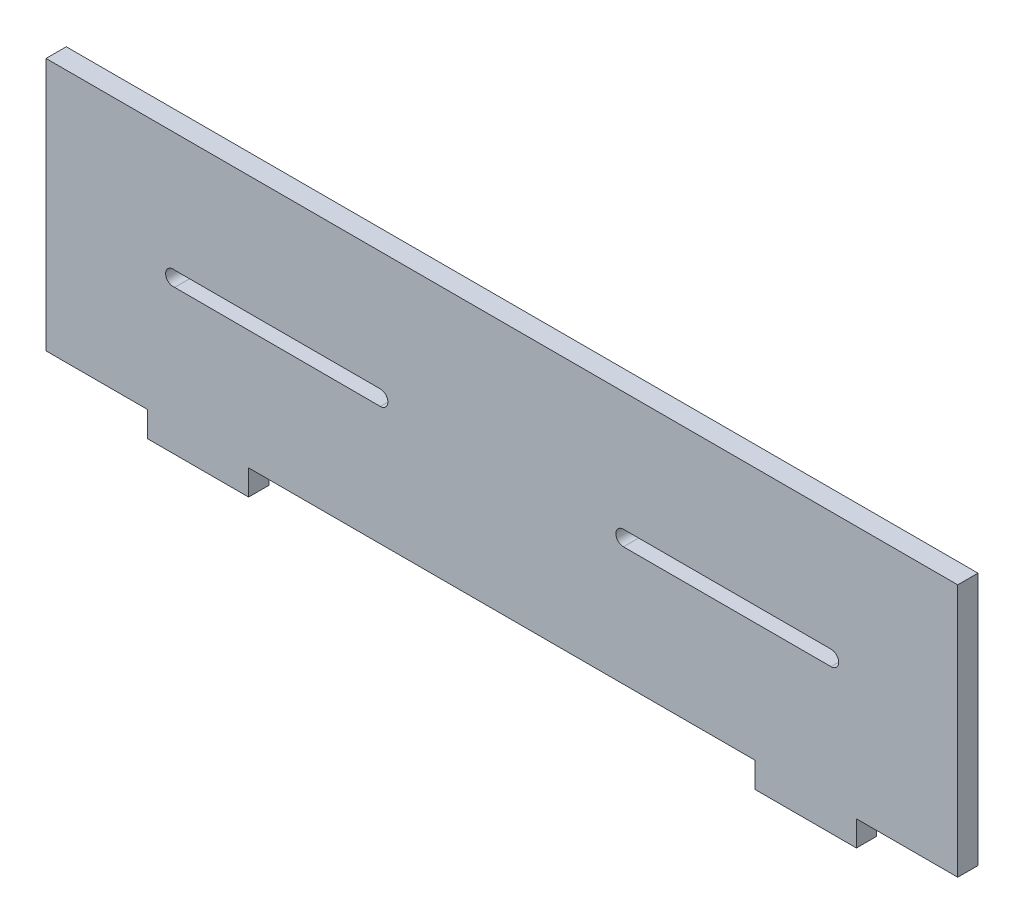
ISO-10303-21;
HEADER;
FILE_DESCRIPTION(('STEP AP214'),'2;1');
FILE_NAME('part.step','',(''),(''),'','','');
FILE_SCHEMA(('AUTOMOTIVE_DESIGN { 1 0 10303 214 1 1 1 1 }'));
ENDSEC;
DATA;
#1=APPLICATION_CONTEXT('core data for automotive mechanical design processes');
#2=APPLICATION_PROTOCOL_DEFINITION('international standard','automotive_design',2000,#1);
#3=PRODUCT_CONTEXT('',#1,'mechanical');
#4=PRODUCT('Part','Part','',(#3));
#5=PRODUCT_RELATED_PRODUCT_CATEGORY('part','',(#4));
#6=PRODUCT_DEFINITION_FORMATION('','',#4);
#7=PRODUCT_DEFINITION_CONTEXT('part definition',#1,'design');
#8=PRODUCT_DEFINITION('design','',#6,#7);
#9=PRODUCT_DEFINITION_SHAPE('','',#8);
#10=(LENGTH_UNIT() NAMED_UNIT(*) SI_UNIT(.MILLI.,.METRE.));
#11=(NAMED_UNIT(*) PLANE_ANGLE_UNIT() SI_UNIT($,.RADIAN.));
#12=(NAMED_UNIT(*) SI_UNIT($,.STERADIAN.) SOLID_ANGLE_UNIT());
#13=UNCERTAINTY_MEASURE_WITH_UNIT(LENGTH_MEASURE(1.E-05),#10,'distance_accuracy_value','');
#14=(GEOMETRIC_REPRESENTATION_CONTEXT(3) GLOBAL_UNCERTAINTY_ASSIGNED_CONTEXT((#13)) GLOBAL_UNIT_ASSIGNED_CONTEXT((#10,
#11,#12)) REPRESENTATION_CONTEXT('',''));
#15=CARTESIAN_POINT('',(0.,0.,0.));
#16=DIRECTION('',(0.,0.,1.));
#17=DIRECTION('',(1.,0.,0.));
#18=AXIS2_PLACEMENT_3D('',#15,#16,#17);
#19=CARTESIAN_POINT('',(72.7006420545748,-2.01784816785052E-13,4.));
#20=DIRECTION('',(1.,0.,0.));
#21=DIRECTION('',(0.,1.,0.));
#22=AXIS2_PLACEMENT_3D('',#19,#20,#21);
#23=PLANE('',#22);
#24=DIRECTION('',(0.,-1.,0.));
#25=VECTOR('',#24,1.);
#26=CARTESIAN_POINT('',(72.7006420545748,-2.01784816785052E-13,0.));
#27=LINE('',#26,#25);
#28=CARTESIAN_POINT('',(72.7006420545747,-31.117125984252,0.));
#29=VERTEX_POINT('',#28);
#30=CARTESIAN_POINT('',(72.7006420545747,-36.117125984252,0.));
#31=VERTEX_POINT('',#30);
#32=EDGE_CURVE('E275',#29,#31,#27,.T.);
#33=ORIENTED_EDGE('',*,*,#32,.F.);
#34=DIRECTION('',(0.,0.,-1.));
#35=VECTOR('',#34,1.);
#36=CARTESIAN_POINT('',(72.7006420545747,-31.117125984252,4.));
#37=LINE('',#36,#35);
#38=CARTESIAN_POINT('',(72.7006420545747,-31.117125984252,4.));
#39=VERTEX_POINT('',#38);
#40=EDGE_CURVE('E11',#39,#29,#37,.T.);
#41=ORIENTED_EDGE('',*,*,#40,.F.);
#42=DIRECTION('',(0.,-1.,0.));
#43=VECTOR('',#42,1.);
#44=CARTESIAN_POINT('',(72.7006420545748,-2.01784816785052E-13,4.));
#45=LINE('',#44,#43);
#46=CARTESIAN_POINT('',(72.7006420545747,-36.117125984252,4.));
#47=VERTEX_POINT('',#46);
#48=EDGE_CURVE('E323',#39,#47,#45,.T.);
#49=ORIENTED_EDGE('',*,*,#48,.T.);
#50=DIRECTION('',(0.,0.,-1.));
#51=VECTOR('',#50,1.);
#52=CARTESIAN_POINT('',(72.7006420545747,-36.117125984252,4.));
#53=LINE('',#52,#51);
#54=EDGE_CURVE('E122',#47,#31,#53,.T.);
#55=ORIENTED_EDGE('',*,*,#54,.T.);
#56=EDGE_LOOP('',(#33,#41,#49,#55));
#57=FACE_BOUND('',#56,.T.);
#58=ADVANCED_FACE('F33',(#57),#23,.T.);
#59=CARTESIAN_POINT('',(0.,-31.117125984252,4.));
#60=DIRECTION('',(0.,1.,0.));
#61=DIRECTION('',(0.,0.,1.));
#62=AXIS2_PLACEMENT_3D('',#59,#60,#61);
#63=PLANE('',#62);
#64=DIRECTION('',(1.,0.,0.));
#65=VECTOR('',#64,1.);
#66=CARTESIAN_POINT('',(0.,-31.117125984252,0.));
#67=LINE('',#66,#65);
#68=CARTESIAN_POINT('',(92.7006420545746,-31.117125984252,0.));
#69=VERTEX_POINT('',#68);
#70=EDGE_CURVE('E277',#29,#69,#67,.T.);
#71=ORIENTED_EDGE('',*,*,#70,.T.);
#72=DIRECTION('',(0.,0.,-1.));
#73=VECTOR('',#72,1.);
#74=CARTESIAN_POINT('',(92.7006420545746,-31.117125984252,4.));
#75=LINE('',#74,#73);
#76=CARTESIAN_POINT('',(92.7006420545746,-31.117125984252,4.));
#77=VERTEX_POINT('',#76);
#78=EDGE_CURVE('E43',#77,#69,#75,.T.);
#79=ORIENTED_EDGE('',*,*,#78,.F.);
#80=DIRECTION('',(1.,0.,0.));
#81=VECTOR('',#80,1.);
#82=CARTESIAN_POINT('',(0.,-31.117125984252,4.));
#83=LINE('',#82,#81);
#84=EDGE_CURVE('E325',#39,#77,#83,.T.);
#85=ORIENTED_EDGE('',*,*,#84,.F.);
#86=ORIENTED_EDGE('',*,*,#40,.T.);
#87=EDGE_LOOP('',(#71,#79,#85,#86));
#88=FACE_BOUND('',#87,.T.);
#89=ADVANCED_FACE('F372',(#88),#63,.F.);
#90=CARTESIAN_POINT('',(92.7006420545746,0.,4.));
#91=DIRECTION('',(1.,0.,0.));
#92=DIRECTION('',(0.,0.,-1.));
#93=AXIS2_PLACEMENT_3D('',#90,#91,#92);
#94=PLANE('',#93);
#95=DIRECTION('',(0.,-1.,0.));
#96=VECTOR('',#95,1.);
#97=CARTESIAN_POINT('',(92.7006420545746,0.,0.));
#98=LINE('',#97,#96);
#99=CARTESIAN_POINT('',(92.7006420545746,18.882874015748,0.));
#100=VERTEX_POINT('',#99);
#101=EDGE_CURVE('E280',#100,#69,#98,.T.);
#102=ORIENTED_EDGE('',*,*,#101,.F.);
#103=DIRECTION('',(0.,0.,-1.));
#104=VECTOR('',#103,1.);
#105=CARTESIAN_POINT('',(92.7006420545746,18.882874015748,4.));
#106=LINE('',#105,#104);
#107=CARTESIAN_POINT('',(92.7006420545746,18.882874015748,4.));
#108=VERTEX_POINT('',#107);
#109=EDGE_CURVE('E220',#108,#100,#106,.T.);
#110=ORIENTED_EDGE('',*,*,#109,.F.);
#111=DIRECTION('',(0.,-1.,0.));
#112=VECTOR('',#111,1.);
#113=CARTESIAN_POINT('',(92.7006420545746,0.,4.));
#114=LINE('',#113,#112);
#115=EDGE_CURVE('E327',#108,#77,#114,.T.);
#116=ORIENTED_EDGE('',*,*,#115,.T.);
#117=ORIENTED_EDGE('',*,*,#78,.T.);
#118=EDGE_LOOP('',(#102,#110,#116,#117));
#119=FACE_BOUND('',#118,.T.);
#120=ADVANCED_FACE('F367',(#119),#94,.T.);
#121=CARTESIAN_POINT('',(0.,18.882874015748,4.));
#122=DIRECTION('',(0.,1.,0.));
#123=DIRECTION('',(0.,0.,1.));
#124=AXIS2_PLACEMENT_3D('',#121,#122,#123);
#125=PLANE('',#124);
#126=DIRECTION('',(1.,0.,0.));
#127=VECTOR('',#126,1.);
#128=CARTESIAN_POINT('',(0.,18.882874015748,0.));
#129=LINE('',#128,#127);
#130=CARTESIAN_POINT('',(-87.2993579454253,18.882874015748,0.));
#131=VERTEX_POINT('',#130);
#132=EDGE_CURVE('E283',#131,#100,#129,.T.);
#133=ORIENTED_EDGE('',*,*,#132,.F.);
#134=DIRECTION('',(0.,0.,-1.));
#135=VECTOR('',#134,1.);
#136=CARTESIAN_POINT('',(-87.2993579454253,18.882874015748,4.));
#137=LINE('',#136,#135);
#138=CARTESIAN_POINT('',(-87.2993579454253,18.882874015748,4.));
#139=VERTEX_POINT('',#138);
#140=EDGE_CURVE('E218',#139,#131,#137,.T.);
#141=ORIENTED_EDGE('',*,*,#140,.F.);
#142=DIRECTION('',(1.,0.,0.));
#143=VECTOR('',#142,1.);
#144=CARTESIAN_POINT('',(0.,18.882874015748,4.));
#145=LINE('',#144,#143);
#146=EDGE_CURVE('E330',#139,#108,#145,.T.);
#147=ORIENTED_EDGE('',*,*,#146,.T.);
#148=ORIENTED_EDGE('',*,*,#109,.T.);
#149=EDGE_LOOP('',(#133,#141,#147,#148));
#150=FACE_BOUND('',#149,.T.);
#151=ADVANCED_FACE('F361',(#150),#125,.T.);
#152=CARTESIAN_POINT('',(-87.2993579454253,0.,4.));
#153=DIRECTION('',(1.,0.,0.));
#154=DIRECTION('',(0.,1.,0.));
#155=AXIS2_PLACEMENT_3D('',#152,#153,#154);
#156=PLANE('',#155);
#157=DIRECTION('',(0.,-1.,0.));
#158=VECTOR('',#157,1.);
#159=CARTESIAN_POINT('',(-87.2993579454253,0.,0.));
#160=LINE('',#159,#158);
#161=CARTESIAN_POINT('',(-87.2993579454253,-31.117125984252,0.));
#162=VERTEX_POINT('',#161);
#163=EDGE_CURVE('E286',#131,#162,#160,.T.);
#164=ORIENTED_EDGE('',*,*,#163,.T.);
#165=DIRECTION('',(0.,0.,-1.));
#166=VECTOR('',#165,1.);
#167=CARTESIAN_POINT('',(-87.2993579454253,-31.117125984252,4.));
#168=LINE('',#167,#166);
#169=CARTESIAN_POINT('',(-87.2993579454253,-31.117125984252,4.));
#170=VERTEX_POINT('',#169);
#171=EDGE_CURVE('E215',#170,#162,#168,.T.);
#172=ORIENTED_EDGE('',*,*,#171,.F.);
#173=DIRECTION('',(0.,-1.,0.));
#174=VECTOR('',#173,1.);
#175=CARTESIAN_POINT('',(-87.2993579454253,0.,4.));
#176=LINE('',#175,#174);
#177=EDGE_CURVE('E333',#139,#170,#176,.T.);
#178=ORIENTED_EDGE('',*,*,#177,.F.);
#179=ORIENTED_EDGE('',*,*,#140,.T.);
#180=EDGE_LOOP('',(#164,#172,#178,#179));
#181=FACE_BOUND('',#180,.T.);
#182=ADVANCED_FACE('F373',(#181),#156,.F.);
#183=CARTESIAN_POINT('',(0.,-31.117125984252,4.));
#184=DIRECTION('',(0.,1.,0.));
#185=DIRECTION('',(0.,0.,1.));
#186=AXIS2_PLACEMENT_3D('',#183,#184,#185);
#187=PLANE('',#186);
#188=DIRECTION('',(1.,0.,0.));
#189=VECTOR('',#188,1.);
#190=CARTESIAN_POINT('',(0.,-31.117125984252,0.));
#191=LINE('',#190,#189);
#192=CARTESIAN_POINT('',(-67.2993579454253,-31.117125984252,0.));
#193=VERTEX_POINT('',#192);
#194=EDGE_CURVE('E289',#162,#193,#191,.T.);
#195=ORIENTED_EDGE('',*,*,#194,.T.);
#196=DIRECTION('',(0.,0.,-1.));
#197=VECTOR('',#196,1.);
#198=CARTESIAN_POINT('',(-67.2993579454253,-31.117125984252,4.));
#199=LINE('',#198,#197);
#200=CARTESIAN_POINT('',(-67.2993579454253,-31.117125984252,4.));
#201=VERTEX_POINT('',#200);
#202=EDGE_CURVE('E212',#201,#193,#199,.T.);
#203=ORIENTED_EDGE('',*,*,#202,.F.);
#204=DIRECTION('',(1.,0.,0.));
#205=VECTOR('',#204,1.);
#206=CARTESIAN_POINT('',(0.,-31.117125984252,4.));
#207=LINE('',#206,#205);
#208=EDGE_CURVE('E336',#170,#201,#207,.T.);
#209=ORIENTED_EDGE('',*,*,#208,.F.);
#210=ORIENTED_EDGE('',*,*,#171,.T.);
#211=EDGE_LOOP('',(#195,#203,#209,#210));
#212=FACE_BOUND('',#211,.T.);
#213=ADVANCED_FACE('F355',(#212),#187,.F.);
#214=CARTESIAN_POINT('',(-67.2993579454253,0.,4.));
#215=DIRECTION('',(1.,0.,0.));
#216=DIRECTION('',(0.,0.,-1.));
#217=AXIS2_PLACEMENT_3D('',#214,#215,#216);
#218=PLANE('',#217);
#219=DIRECTION('',(0.,-1.,0.));
#220=VECTOR('',#219,1.);
#221=CARTESIAN_POINT('',(-67.2993579454253,0.,0.));
#222=LINE('',#221,#220);
#223=CARTESIAN_POINT('',(-67.2993579454253,-36.117125984252,0.));
#224=VERTEX_POINT('',#223);
#225=EDGE_CURVE('E292',#193,#224,#222,.T.);
#226=ORIENTED_EDGE('',*,*,#225,.T.);
#227=DIRECTION('',(0.,0.,-1.));
#228=VECTOR('',#227,1.);
#229=CARTESIAN_POINT('',(-67.2993579454253,-36.117125984252,4.));
#230=LINE('',#229,#228);
#231=CARTESIAN_POINT('',(-67.2993579454253,-36.117125984252,4.));
#232=VERTEX_POINT('',#231);
#233=EDGE_CURVE('E209',#232,#224,#230,.T.);
#234=ORIENTED_EDGE('',*,*,#233,.F.);
#235=DIRECTION('',(0.,-1.,0.));
#236=VECTOR('',#235,1.);
#237=CARTESIAN_POINT('',(-67.2993579454253,0.,4.));
#238=LINE('',#237,#236);
#239=EDGE_CURVE('E339',#201,#232,#238,.T.);
#240=ORIENTED_EDGE('',*,*,#239,.F.);
#241=ORIENTED_EDGE('',*,*,#202,.T.);
#242=EDGE_LOOP('',(#226,#234,#240,#241));
#243=FACE_BOUND('',#242,.T.);
#244=ADVANCED_FACE('F352',(#243),#218,.F.);
#245=CARTESIAN_POINT('',(0.,-36.117125984252,4.));
#246=DIRECTION('',(0.,1.,0.));
#247=DIRECTION('',(0.,0.,1.));
#248=AXIS2_PLACEMENT_3D('',#245,#246,#247);
#249=PLANE('',#248);
#250=DIRECTION('',(1.,0.,0.));
#251=VECTOR('',#250,1.);
#252=CARTESIAN_POINT('',(0.,-36.117125984252,0.));
#253=LINE('',#252,#251);
#254=CARTESIAN_POINT('',(-47.2993579454253,-36.117125984252,0.));
#255=VERTEX_POINT('',#254);
#256=EDGE_CURVE('E295',#224,#255,#253,.T.);
#257=ORIENTED_EDGE('',*,*,#256,.T.);
#258=DIRECTION('',(0.,0.,-1.));
#259=VECTOR('',#258,1.);
#260=CARTESIAN_POINT('',(-47.2993579454253,-36.117125984252,4.));
#261=LINE('',#260,#259);
#262=CARTESIAN_POINT('',(-47.2993579454253,-36.117125984252,4.));
#263=VERTEX_POINT('',#262);
#264=EDGE_CURVE('E203',#263,#255,#261,.T.);
#265=ORIENTED_EDGE('',*,*,#264,.F.);
#266=DIRECTION('',(1.,0.,0.));
#267=VECTOR('',#266,1.);
#268=CARTESIAN_POINT('',(0.,-36.117125984252,4.));
#269=LINE('',#268,#267);
#270=EDGE_CURVE('E342',#232,#263,#269,.T.);
#271=ORIENTED_EDGE('',*,*,#270,.F.);
#272=ORIENTED_EDGE('',*,*,#233,.T.);
#273=EDGE_LOOP('',(#257,#265,#271,#272));
#274=FACE_BOUND('',#273,.T.);
#275=ADVANCED_FACE('F350',(#274),#249,.F.);
#276=CARTESIAN_POINT('',(-47.2993579454253,0.,4.));
#277=DIRECTION('',(1.,0.,0.));
#278=DIRECTION('',(0.,1.,0.));
#279=AXIS2_PLACEMENT_3D('',#276,#277,#278);
#280=PLANE('',#279);
#281=DIRECTION('',(0.,-1.,0.));
#282=VECTOR('',#281,1.);
#283=CARTESIAN_POINT('',(-47.2993579454253,0.,0.));
#284=LINE('',#283,#282);
#285=CARTESIAN_POINT('',(-47.2993579454253,-31.117125984252,0.));
#286=VERTEX_POINT('',#285);
#287=EDGE_CURVE('E298',#286,#255,#284,.T.);
#288=ORIENTED_EDGE('',*,*,#287,.F.);
#289=DIRECTION('',(0.,0.,-1.));
#290=VECTOR('',#289,1.);
#291=CARTESIAN_POINT('',(-47.2993579454253,-31.117125984252,4.));
#292=LINE('',#291,#290);
#293=CARTESIAN_POINT('',(-47.2993579454253,-31.117125984252,4.));
#294=VERTEX_POINT('',#293);
#295=EDGE_CURVE('E201',#294,#286,#292,.T.);
#296=ORIENTED_EDGE('',*,*,#295,.F.);
#297=DIRECTION('',(0.,-1.,0.));
#298=VECTOR('',#297,1.);
#299=CARTESIAN_POINT('',(-47.2993579454253,0.,4.));
#300=LINE('',#299,#298);
#301=EDGE_CURVE('E195',#294,#263,#300,.T.);
#302=ORIENTED_EDGE('',*,*,#301,.T.);
#303=ORIENTED_EDGE('',*,*,#264,.T.);
#304=EDGE_LOOP('',(#288,#296,#302,#303));
#305=FACE_BOUND('',#304,.T.);
#306=ADVANCED_FACE('F346',(#305),#280,.T.);
#307=CARTESIAN_POINT('',(0.,-31.117125984252,4.));
#308=DIRECTION('',(0.,1.,0.));
#309=DIRECTION('',(0.,0.,1.));
#310=AXIS2_PLACEMENT_3D('',#307,#308,#309);
#311=PLANE('',#310);
#312=DIRECTION('',(1.,0.,0.));
#313=VECTOR('',#312,1.);
#314=CARTESIAN_POINT('',(0.,-31.117125984252,0.));
#315=LINE('',#314,#313);
#316=CARTESIAN_POINT('',(52.7006420545747,-31.117125984252,0.));
#317=VERTEX_POINT('',#316);
#318=EDGE_CURVE('E200',#286,#317,#315,.T.);
#319=ORIENTED_EDGE('',*,*,#318,.T.);
#320=DIRECTION('',(0.,0.,-1.));
#321=VECTOR('',#320,1.);
#322=CARTESIAN_POINT('',(52.7006420545747,-31.117125984252,4.));
#323=LINE('',#322,#321);
#324=CARTESIAN_POINT('',(52.7006420545747,-31.117125984252,4.));
#325=VERTEX_POINT('',#324);
#326=EDGE_CURVE('E186',#325,#317,#323,.T.);
#327=ORIENTED_EDGE('',*,*,#326,.F.);
#328=DIRECTION('',(1.,0.,0.));
#329=VECTOR('',#328,1.);
#330=CARTESIAN_POINT('',(0.,-31.117125984252,4.));
#331=LINE('',#330,#329);
#332=EDGE_CURVE('E189',#294,#325,#331,.T.);
#333=ORIENTED_EDGE('',*,*,#332,.F.);
#334=ORIENTED_EDGE('',*,*,#295,.T.);
#335=EDGE_LOOP('',(#319,#327,#333,#334));
#336=FACE_BOUND('',#335,.T.);
#337=ADVANCED_FACE('F198',(#336),#311,.F.);
#338=CARTESIAN_POINT('',(52.7006420545747,0.,4.));
#339=DIRECTION('',(1.,0.,0.));
#340=DIRECTION('',(0.,0.,-1.));
#341=AXIS2_PLACEMENT_3D('',#338,#339,#340);
#342=PLANE('',#341);
#343=DIRECTION('',(0.,-1.,0.));
#344=VECTOR('',#343,1.);
#345=CARTESIAN_POINT('',(52.7006420545747,0.,0.));
#346=LINE('',#345,#344);
#347=CARTESIAN_POINT('',(52.7006420545747,-36.117125984252,0.));
#348=VERTEX_POINT('',#347);
#349=EDGE_CURVE('E302',#317,#348,#346,.T.);
#350=ORIENTED_EDGE('',*,*,#349,.T.);
#351=DIRECTION('',(0.,0.,-1.));
#352=VECTOR('',#351,1.);
#353=CARTESIAN_POINT('',(52.7006420545747,-36.117125984252,4.));
#354=LINE('',#353,#352);
#355=CARTESIAN_POINT('',(52.7006420545747,-36.117125984252,4.));
#356=VERTEX_POINT('',#355);
#357=EDGE_CURVE('E188',#356,#348,#354,.T.);
#358=ORIENTED_EDGE('',*,*,#357,.F.);
#359=DIRECTION('',(0.,-1.,0.));
#360=VECTOR('',#359,1.);
#361=CARTESIAN_POINT('',(52.7006420545747,0.,4.));
#362=LINE('',#361,#360);
#363=EDGE_CURVE('E181',#325,#356,#362,.T.);
#364=ORIENTED_EDGE('',*,*,#363,.F.);
#365=ORIENTED_EDGE('',*,*,#326,.T.);
#366=EDGE_LOOP('',(#350,#358,#364,#365));
#367=FACE_BOUND('',#366,.T.);
#368=ADVANCED_FACE('F184',(#367),#342,.F.);
#369=CARTESIAN_POINT('',(-21.3013998345397,-6.1171232047009,4.));
#370=DIRECTION('',(0.,0.,-1.));
#371=DIRECTION('',(-1.,0.,0.));
#372=AXIS2_PLACEMENT_3D('',#369,#370,#371);
#373=CYLINDRICAL_SURFACE('',#372,1.4999958306676);
#374=CARTESIAN_POINT('',(-21.3013998345397,-6.1171232047009,0.));
#375=DIRECTION('',(0.,0.,1.));
#376=DIRECTION('',(1.,0.,0.));
#377=AXIS2_PLACEMENT_3D('',#374,#375,#376);
#378=CIRCLE('',#377,1.4999958306676);
#379=CARTESIAN_POINT('',(-21.2993579454253,-7.61712320469575,0.));
#380=VERTEX_POINT('',#379);
#381=CARTESIAN_POINT('',(-21.2993579454253,-4.6171287638082,0.));
#382=VERTEX_POINT('',#381);
#383=EDGE_CURVE('E263',#380,#382,#378,.T.);
#384=ORIENTED_EDGE('',*,*,#383,.F.);
#385=DIRECTION('',(0.,0.,-1.));
#386=VECTOR('',#385,1.);
#387=CARTESIAN_POINT('',(-21.2993579454253,-7.61712320469575,4.));
#388=LINE('',#387,#386);
#389=CARTESIAN_POINT('',(-21.2993579454253,-7.61712320469575,4.));
#390=VERTEX_POINT('',#389);
#391=EDGE_CURVE('E229',#390,#380,#388,.T.);
#392=ORIENTED_EDGE('',*,*,#391,.F.);
#393=CARTESIAN_POINT('',(-21.3013998345397,-6.1171232047009,4.));
#394=DIRECTION('',(0.,0.,1.));
#395=DIRECTION('',(1.,0.,0.));
#396=AXIS2_PLACEMENT_3D('',#393,#394,#395);
#397=CIRCLE('',#396,1.4999958306676);
#398=CARTESIAN_POINT('',(-21.2993579454253,-4.6171287638082,4.));
#399=VERTEX_POINT('',#398);
#400=EDGE_CURVE('E313',#390,#399,#397,.T.);
#401=ORIENTED_EDGE('',*,*,#400,.T.);
#402=DIRECTION('',(0.,0.,-1.));
#403=VECTOR('',#402,1.);
#404=CARTESIAN_POINT('',(-21.2993579454253,-4.6171287638082,4.));
#405=LINE('',#404,#403);
#406=EDGE_CURVE('E223',#399,#382,#405,.T.);
#407=ORIENTED_EDGE('',*,*,#406,.T.);
#408=EDGE_LOOP('',(#384,#392,#401,#407));
#409=FACE_BOUND('',#408,.T.);
#410=ADVANCED_FACE('F403',(#409),#373,.F.);
#411=CARTESIAN_POINT('',(-0.0104083683592655,-7.64610309503021,4.));
#412=DIRECTION('',(-0.00136126319333543,-0.99999907348083,0.));
#413=DIRECTION('',(0.99999907348083,-0.00136126319333543,0.));
#414=AXIS2_PLACEMENT_3D('',#411,#412,#413);
#415=PLANE('',#414);
#416=DIRECTION('',(-0.99999907348083,0.00136126319333543,0.));
#417=VECTOR('',#416,1.);
#418=CARTESIAN_POINT('',(-0.0104083683592655,-7.64610309503021,0.));
#419=LINE('',#418,#417);
#420=CARTESIAN_POINT('',(-61.8973969093349,-7.56185853732881,0.));
#421=VERTEX_POINT('',#420);
#422=EDGE_CURVE('E266',#380,#421,#419,.T.);
#423=ORIENTED_EDGE('',*,*,#422,.T.);
#424=DIRECTION('',(0.,0.,-1.));
#425=VECTOR('',#424,1.);
#426=CARTESIAN_POINT('',(-61.8973969093349,-7.56185853732881,4.));
#427=LINE('',#426,#425);
#428=CARTESIAN_POINT('',(-61.8973969093349,-7.56185853732881,4.));
#429=VERTEX_POINT('',#428);
#430=EDGE_CURVE('E227',#429,#421,#427,.T.);
#431=ORIENTED_EDGE('',*,*,#430,.F.);
#432=DIRECTION('',(-0.99999907348083,0.00136126319333543,0.));
#433=VECTOR('',#432,1.);
#434=CARTESIAN_POINT('',(-0.0104083683592655,-7.64610309503021,4.));
#435=LINE('',#434,#433);
#436=EDGE_CURVE('E316',#390,#429,#435,.T.);
#437=ORIENTED_EDGE('',*,*,#436,.F.);
#438=ORIENTED_EDGE('',*,*,#391,.T.);
#439=EDGE_LOOP('',(#423,#431,#437,#438));
#440=FACE_BOUND('',#439,.T.);
#441=ADVANCED_FACE('F399',(#440),#415,.F.);
#442=CARTESIAN_POINT('',(-62.1819826913385,-6.08910230064828,4.));
#443=DIRECTION('',(0.,0.,-1.));
#444=DIRECTION('',(-1.,0.,0.));
#445=AXIS2_PLACEMENT_3D('',#442,#443,#444);
#446=CYLINDRICAL_SURFACE('',#445,1.5);
#447=CARTESIAN_POINT('',(-62.1819826913385,-6.08910230064828,0.));
#448=DIRECTION('',(0.,0.,1.));
#449=DIRECTION('',(1.,0.,0.));
#450=AXIS2_PLACEMENT_3D('',#447,#448,#449);
#451=CIRCLE('',#450,1.5);
#452=CARTESIAN_POINT('',(-61.8933758535081,-4.6171287638082,0.));
#453=VERTEX_POINT('',#452);
#454=EDGE_CURVE('E269',#453,#421,#451,.T.);
#455=ORIENTED_EDGE('',*,*,#454,.F.);
#456=DIRECTION('',(0.,0.,-1.));
#457=VECTOR('',#456,1.);
#458=CARTESIAN_POINT('',(-61.8933758535081,-4.6171287638082,4.));
#459=LINE('',#458,#457);
#460=CARTESIAN_POINT('',(-61.8933758535081,-4.6171287638082,4.));
#461=VERTEX_POINT('',#460);
#462=EDGE_CURVE('E225',#461,#453,#459,.T.);
#463=ORIENTED_EDGE('',*,*,#462,.F.);
#464=CARTESIAN_POINT('',(-62.1819826913385,-6.08910230064828,4.));
#465=DIRECTION('',(0.,0.,1.));
#466=DIRECTION('',(1.,0.,0.));
#467=AXIS2_PLACEMENT_3D('',#464,#465,#466);
#468=CIRCLE('',#467,1.5);
#469=EDGE_CURVE('E318',#461,#429,#468,.T.);
#470=ORIENTED_EDGE('',*,*,#469,.T.);
#471=ORIENTED_EDGE('',*,*,#430,.T.);
#472=EDGE_LOOP('',(#455,#463,#470,#471));
#473=FACE_BOUND('',#472,.T.);
#474=ADVANCED_FACE('F396',(#473),#446,.F.);
#475=CARTESIAN_POINT('',(67.7006420545739,-6.11712737403008,4.));
#476=DIRECTION('',(0.,0.,-1.));
#477=DIRECTION('',(-1.,0.,0.));
#478=AXIS2_PLACEMENT_3D('',#475,#476,#477);
#479=CYLINDRICAL_SURFACE('',#478,1.5);
#480=CARTESIAN_POINT('',(67.7006420545739,-6.11712737403008,0.));
#481=DIRECTION('',(0.,0.,1.));
#482=DIRECTION('',(1.,0.,0.));
#483=AXIS2_PLACEMENT_3D('',#480,#481,#482);
#484=CIRCLE('',#483,1.5);
#485=CARTESIAN_POINT('',(67.6882909276466,-7.61707652305601,0.));
#486=VERTEX_POINT('',#485);
#487=CARTESIAN_POINT('',(67.6882910293186,-4.61717822416695,0.));
#488=VERTEX_POINT('',#487);
#489=EDGE_CURVE('E252',#486,#488,#484,.T.);
#490=ORIENTED_EDGE('',*,*,#489,.F.);
#491=DIRECTION('',(0.,0.,-1.));
#492=VECTOR('',#491,1.);
#493=CARTESIAN_POINT('',(67.6882909276466,-7.61707652305601,4.));
#494=LINE('',#493,#492);
#495=CARTESIAN_POINT('',(67.6882909276466,-7.61707652305601,4.));
#496=VERTEX_POINT('',#495);
#497=EDGE_CURVE('E37',#496,#486,#494,.T.);
#498=ORIENTED_EDGE('',*,*,#497,.F.);
#499=CARTESIAN_POINT('',(67.7006420545739,-6.11712737403008,4.));
#500=DIRECTION('',(0.,0.,1.));
#501=DIRECTION('',(1.,0.,0.));
#502=AXIS2_PLACEMENT_3D('',#499,#500,#501);
#503=CIRCLE('',#502,1.5);
#504=CARTESIAN_POINT('',(67.6882910293186,-4.61717822416695,4.));
#505=VERTEX_POINT('',#504);
#506=EDGE_CURVE('E304',#496,#505,#503,.T.);
#507=ORIENTED_EDGE('',*,*,#506,.T.);
#508=DIRECTION('',(0.,0.,-1.));
#509=VECTOR('',#508,1.);
#510=CARTESIAN_POINT('',(67.6882910293186,-4.61717822416695,4.));
#511=LINE('',#510,#509);
#512=EDGE_CURVE('E231',#505,#488,#511,.T.);
#513=ORIENTED_EDGE('',*,*,#512,.T.);
#514=EDGE_LOOP('',(#490,#498,#507,#513));
#515=FACE_BOUND('',#514,.T.);
#516=ADVANCED_FACE('F35',(#515),#479,.F.);
#517=CARTESIAN_POINT('',(9.19188499567711E-06,-7.6171582048177,4.));
#518=DIRECTION('',(1.20673415839738E-06,-0.999999999999272,0.));
#519=DIRECTION('',(0.999999999999272,1.20673415839738E-06,0.));
#520=AXIS2_PLACEMENT_3D('',#517,#518,#519);
#521=PLANE('',#520);
#522=DIRECTION('',(-0.999999999999272,-1.20673415839738E-06,0.));
#523=VECTOR('',#522,1.);
#524=CARTESIAN_POINT('',(9.19188499567711E-06,-7.6171582048177,0.));
#525=LINE('',#524,#523);
#526=CARTESIAN_POINT('',(26.7006420545747,-7.61712598425198,0.));
#527=VERTEX_POINT('',#526);
#528=EDGE_CURVE('E243',#486,#527,#525,.T.);
#529=ORIENTED_EDGE('',*,*,#528,.T.);
#530=DIRECTION('',(0.,0.,-1.));
#531=VECTOR('',#530,1.);
#532=CARTESIAN_POINT('',(26.7006420545747,-7.61712598425198,4.));
#533=LINE('',#532,#531);
#534=CARTESIAN_POINT('',(26.7006420545747,-7.61712598425198,4.));
#535=VERTEX_POINT('',#534);
#536=EDGE_CURVE('E234',#535,#527,#533,.T.);
#537=ORIENTED_EDGE('',*,*,#536,.F.);
#538=DIRECTION('',(-0.999999999999272,-1.20673415839738E-06,0.));
#539=VECTOR('',#538,1.);
#540=CARTESIAN_POINT('',(9.19188499567711E-06,-7.6171582048177,4.));
#541=LINE('',#540,#539);
#542=EDGE_CURVE('E245',#496,#535,#541,.T.);
#543=ORIENTED_EDGE('',*,*,#542,.F.);
#544=ORIENTED_EDGE('',*,*,#497,.T.);
#545=EDGE_LOOP('',(#529,#537,#543,#544));
#546=FACE_BOUND('',#545,.T.);
#547=ADVANCED_FACE('F242',(#546),#521,.F.);
#548=CARTESIAN_POINT('',(26.7006420545747,-6.11712598425197,4.));
#549=DIRECTION('',(0.,0.,-1.));
#550=DIRECTION('',(-1.,0.,0.));
#551=AXIS2_PLACEMENT_3D('',#548,#549,#550);
#552=CYLINDRICAL_SURFACE('',#551,1.5);
#553=CARTESIAN_POINT('',(26.7006420545747,-6.11712598425197,0.));
#554=DIRECTION('',(0.,0.,1.));
#555=DIRECTION('',(1.,0.,0.));
#556=AXIS2_PLACEMENT_3D('',#553,#554,#555);
#557=CIRCLE('',#556,1.5);
#558=CARTESIAN_POINT('',(26.7006420545747,-4.61712598425197,0.));
#559=VERTEX_POINT('',#558);
#560=EDGE_CURVE('E253',#559,#527,#557,.T.);
#561=ORIENTED_EDGE('',*,*,#560,.F.);
#562=DIRECTION('',(0.,0.,-1.));
#563=VECTOR('',#562,1.);
#564=CARTESIAN_POINT('',(26.7006420545747,-4.61712598425197,4.));
#565=LINE('',#564,#563);
#566=CARTESIAN_POINT('',(26.7006420545747,-4.61712598425197,4.));
#567=VERTEX_POINT('',#566);
#568=EDGE_CURVE('E233',#567,#559,#565,.T.);
#569=ORIENTED_EDGE('',*,*,#568,.F.);
#570=CARTESIAN_POINT('',(26.7006420545747,-6.11712598425197,4.));
#571=DIRECTION('',(0.,0.,1.));
#572=DIRECTION('',(1.,0.,0.));
#573=AXIS2_PLACEMENT_3D('',#570,#571,#572);
#574=CIRCLE('',#573,1.5);
#575=EDGE_CURVE('E307',#567,#535,#574,.T.);
#576=ORIENTED_EDGE('',*,*,#575,.T.);
#577=ORIENTED_EDGE('',*,*,#536,.T.);
#578=EDGE_LOOP('',(#561,#569,#576,#577));
#579=FACE_BOUND('',#578,.T.);
#580=ADVANCED_FACE('F394',(#579),#552,.F.);
#581=CARTESIAN_POINT('',(0.,-4.6171287638082,4.));
#582=DIRECTION('',(0.,1.,0.));
#583=DIRECTION('',(0.,0.,1.));
#584=AXIS2_PLACEMENT_3D('',#581,#582,#583);
#585=PLANE('',#584);
#586=DIRECTION('',(1.,0.,0.));
#587=VECTOR('',#586,1.);
#588=CARTESIAN_POINT('',(0.,-4.6171287638082,0.));
#589=LINE('',#588,#587);
#590=EDGE_CURVE('E272',#453,#382,#589,.T.);
#591=ORIENTED_EDGE('',*,*,#590,.T.);
#592=ORIENTED_EDGE('',*,*,#406,.F.);
#593=DIRECTION('',(1.,0.,0.));
#594=VECTOR('',#593,1.);
#595=CARTESIAN_POINT('',(0.,-4.6171287638082,4.));
#596=LINE('',#595,#594);
#597=EDGE_CURVE('E321',#461,#399,#596,.T.);
#598=ORIENTED_EDGE('',*,*,#597,.F.);
#599=ORIENTED_EDGE('',*,*,#462,.T.);
#600=EDGE_LOOP('',(#591,#592,#598,#599));
#601=FACE_BOUND('',#600,.T.);
#602=ADVANCED_FACE('F390',(#601),#585,.F.);
#603=CARTESIAN_POINT('',(-5.88461395376905E-06,-4.61709195352288,4.));
#604=DIRECTION('',(1.27452821234679E-06,0.999999999999188,0.));
#605=DIRECTION('',(-0.999999999999188,1.27452821234679E-06,0.));
#606=AXIS2_PLACEMENT_3D('',#603,#604,#605);
#607=PLANE('',#606);
#608=DIRECTION('',(0.999999999999188,-1.27452821234679E-06,0.));
#609=VECTOR('',#608,1.);
#610=CARTESIAN_POINT('',(-5.88461395376905E-06,-4.61709195352288,0.));
#611=LINE('',#610,#609);
#612=EDGE_CURVE('E261',#559,#488,#611,.T.);
#613=ORIENTED_EDGE('',*,*,#612,.T.);
#614=ORIENTED_EDGE('',*,*,#512,.F.);
#615=DIRECTION('',(0.999999999999188,-1.27452821234679E-06,0.));
#616=VECTOR('',#615,1.);
#617=CARTESIAN_POINT('',(-5.88461395376905E-06,-4.61709195352288,4.));
#618=LINE('',#617,#616);
#619=EDGE_CURVE('E311',#567,#505,#618,.T.);
#620=ORIENTED_EDGE('',*,*,#619,.F.);
#621=ORIENTED_EDGE('',*,*,#568,.T.);
#622=EDGE_LOOP('',(#613,#614,#620,#621));
#623=FACE_BOUND('',#622,.T.);
#624=ADVANCED_FACE('F393',(#623),#607,.F.);
#625=CARTESIAN_POINT('',(0.,-36.117125984252,4.));
#626=DIRECTION('',(0.,1.,0.));
#627=DIRECTION('',(0.,0.,1.));
#628=AXIS2_PLACEMENT_3D('',#625,#626,#627);
#629=PLANE('',#628);
#630=DIRECTION('',(1.,0.,0.));
#631=VECTOR('',#630,1.);
#632=CARTESIAN_POINT('',(0.,-36.117125984252,0.));
#633=LINE('',#632,#631);
#634=EDGE_CURVE('E115',#348,#31,#633,.T.);
#635=ORIENTED_EDGE('',*,*,#634,.T.);
#636=ORIENTED_EDGE('',*,*,#54,.F.);
#637=DIRECTION('',(1.,0.,0.));
#638=VECTOR('',#637,1.);
#639=CARTESIAN_POINT('',(0.,-36.117125984252,4.));
#640=LINE('',#639,#638);
#641=EDGE_CURVE('E52',#356,#47,#640,.T.);
#642=ORIENTED_EDGE('',*,*,#641,.F.);
#643=ORIENTED_EDGE('',*,*,#357,.T.);
#644=EDGE_LOOP('',(#635,#636,#642,#643));
#645=FACE_BOUND('',#644,.T.);
#646=ADVANCED_FACE('F410',(#645),#629,.F.);
#647=CARTESIAN_POINT('',(0.,0.,4.));
#648=DIRECTION('',(0.,0.,1.));
#649=DIRECTION('',(1.,0.,0.));
#650=AXIS2_PLACEMENT_3D('',#647,#648,#649);
#651=PLANE('',#650);
#652=ORIENTED_EDGE('',*,*,#506,.F.);
#653=ORIENTED_EDGE('',*,*,#542,.T.);
#654=ORIENTED_EDGE('',*,*,#575,.F.);
#655=ORIENTED_EDGE('',*,*,#619,.T.);
#656=EDGE_LOOP('',(#652,#653,#654,#655));
#657=FACE_BOUND('',#656,.T.);
#658=ORIENTED_EDGE('',*,*,#400,.F.);
#659=ORIENTED_EDGE('',*,*,#436,.T.);
#660=ORIENTED_EDGE('',*,*,#469,.F.);
#661=ORIENTED_EDGE('',*,*,#597,.T.);
#662=EDGE_LOOP('',(#658,#659,#660,#661));
#663=FACE_BOUND('',#662,.T.);
#664=ORIENTED_EDGE('',*,*,#48,.F.);
#665=ORIENTED_EDGE('',*,*,#84,.T.);
#666=ORIENTED_EDGE('',*,*,#115,.F.);
#667=ORIENTED_EDGE('',*,*,#146,.F.);
#668=ORIENTED_EDGE('',*,*,#177,.T.);
#669=ORIENTED_EDGE('',*,*,#208,.T.);
#670=ORIENTED_EDGE('',*,*,#239,.T.);
#671=ORIENTED_EDGE('',*,*,#270,.T.);
#672=ORIENTED_EDGE('',*,*,#301,.F.);
#673=ORIENTED_EDGE('',*,*,#332,.T.);
#674=ORIENTED_EDGE('',*,*,#363,.T.);
#675=ORIENTED_EDGE('',*,*,#641,.T.);
#676=EDGE_LOOP('',(#664,#665,#666,#667,#668,#669,#670,#671,#672,#673,#674,#675));
#677=FACE_BOUND('',#676,.T.);
#678=ADVANCED_FACE('F193',(#657,#663,#677),#651,.T.);
#679=CARTESIAN_POINT('',(0.,0.,0.));
#680=DIRECTION('',(0.,0.,1.));
#681=DIRECTION('',(1.,0.,0.));
#682=AXIS2_PLACEMENT_3D('',#679,#680,#681);
#683=PLANE('',#682);
#684=ORIENTED_EDGE('',*,*,#489,.T.);
#685=ORIENTED_EDGE('',*,*,#612,.F.);
#686=ORIENTED_EDGE('',*,*,#560,.T.);
#687=ORIENTED_EDGE('',*,*,#528,.F.);
#688=EDGE_LOOP('',(#684,#685,#686,#687));
#689=FACE_BOUND('',#688,.T.);
#690=ORIENTED_EDGE('',*,*,#383,.T.);
#691=ORIENTED_EDGE('',*,*,#590,.F.);
#692=ORIENTED_EDGE('',*,*,#454,.T.);
#693=ORIENTED_EDGE('',*,*,#422,.F.);
#694=EDGE_LOOP('',(#690,#691,#692,#693));
#695=FACE_BOUND('',#694,.T.);
#696=ORIENTED_EDGE('',*,*,#32,.T.);
#697=ORIENTED_EDGE('',*,*,#634,.F.);
#698=ORIENTED_EDGE('',*,*,#349,.F.);
#699=ORIENTED_EDGE('',*,*,#318,.F.);
#700=ORIENTED_EDGE('',*,*,#287,.T.);
#701=ORIENTED_EDGE('',*,*,#256,.F.);
#702=ORIENTED_EDGE('',*,*,#225,.F.);
#703=ORIENTED_EDGE('',*,*,#194,.F.);
#704=ORIENTED_EDGE('',*,*,#163,.F.);
#705=ORIENTED_EDGE('',*,*,#132,.T.);
#706=ORIENTED_EDGE('',*,*,#101,.T.);
#707=ORIENTED_EDGE('',*,*,#70,.F.);
#708=EDGE_LOOP('',(#696,#697,#698,#699,#700,#701,#702,#703,#704,#705,#706,#707));
#709=FACE_BOUND('',#708,.T.);
#710=ADVANCED_FACE('F249',(#689,#695,#709),#683,.F.);
#711=CLOSED_SHELL('',(#58,#89,#120,#151,#182,#213,#244,#275,#306,#337,#368,#410,#441,#474,#516,
#547,#580,#602,#624,#646,#678,#710));
#712=MANIFOLD_SOLID_BREP('B2',#711);
#713=ADVANCED_BREP_SHAPE_REPRESENTATION('',(#18,#712),#14);
#714=SHAPE_DEFINITION_REPRESENTATION(#9,#713);
ENDSEC;
END-ISO-10303-21;
